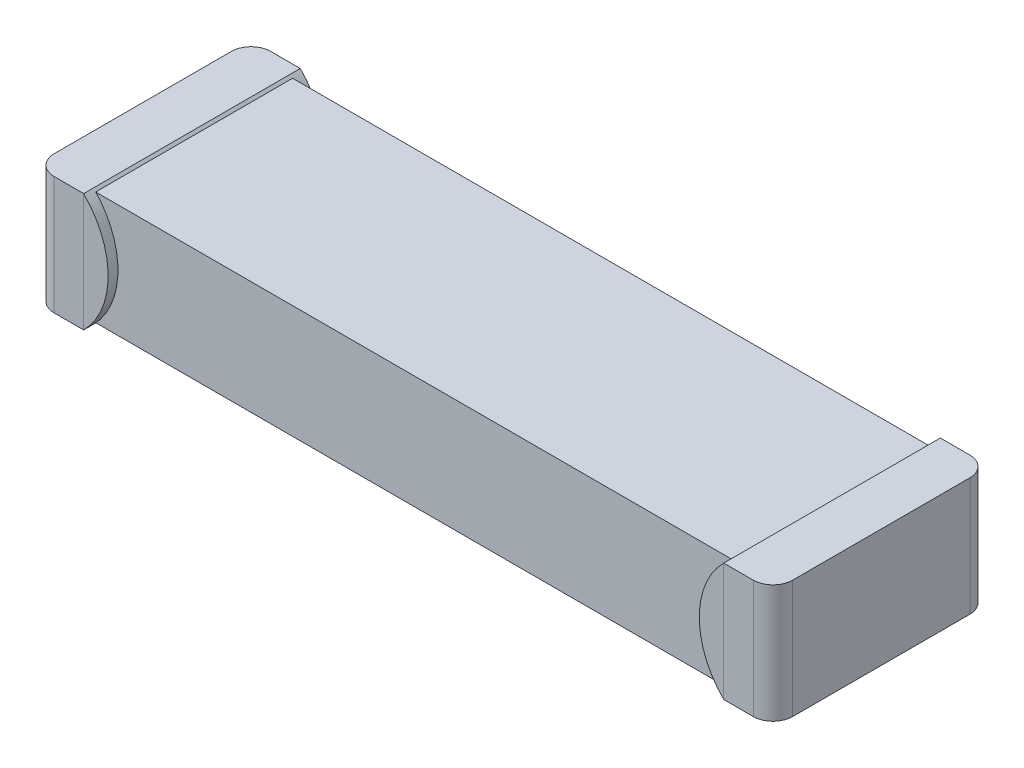
ISO-10303-21;
HEADER;
FILE_DESCRIPTION(('STEP AP214'),'2;1');
FILE_NAME('part.step','',(''),(''),'','','');
FILE_SCHEMA(('AUTOMOTIVE_DESIGN { 1 0 10303 214 1 1 1 1 }'));
ENDSEC;
DATA;
#1=APPLICATION_CONTEXT('core data for automotive mechanical design processes');
#2=APPLICATION_PROTOCOL_DEFINITION('international standard','automotive_design',2000,#1);
#3=PRODUCT_CONTEXT('',#1,'mechanical');
#4=PRODUCT('Part','Part','',(#3));
#5=PRODUCT_RELATED_PRODUCT_CATEGORY('part','',(#4));
#6=PRODUCT_DEFINITION_FORMATION('','',#4);
#7=PRODUCT_DEFINITION_CONTEXT('part definition',#1,'design');
#8=PRODUCT_DEFINITION('design','',#6,#7);
#9=PRODUCT_DEFINITION_SHAPE('','',#8);
#10=(LENGTH_UNIT() NAMED_UNIT(*) SI_UNIT(.MILLI.,.METRE.));
#11=(NAMED_UNIT(*) PLANE_ANGLE_UNIT() SI_UNIT($,.RADIAN.));
#12=(NAMED_UNIT(*) SI_UNIT($,.STERADIAN.) SOLID_ANGLE_UNIT());
#13=UNCERTAINTY_MEASURE_WITH_UNIT(LENGTH_MEASURE(1.E-05),#10,'distance_accuracy_value','');
#14=(GEOMETRIC_REPRESENTATION_CONTEXT(3) GLOBAL_UNCERTAINTY_ASSIGNED_CONTEXT((#13)) GLOBAL_UNIT_ASSIGNED_CONTEXT((#10,
#11,#12)) REPRESENTATION_CONTEXT('',''));
#15=CARTESIAN_POINT('',(0.,0.,0.));
#16=DIRECTION('',(0.,0.,1.));
#17=DIRECTION('',(1.,0.,0.));
#18=AXIS2_PLACEMENT_3D('',#15,#16,#17);
#19=CARTESIAN_POINT('',(-0.100000000000001,0.55,-2.1));
#20=DIRECTION('',(0.,0.,1.));
#21=DIRECTION('',(1.,0.,0.));
#22=AXIS2_PLACEMENT_3D('',#19,#20,#21);
#23=CYLINDRICAL_SURFACE('',#22,0.848528137423857);
#24=CARTESIAN_POINT('',(-0.100000000000001,0.55,0.1));
#25=DIRECTION('',(0.,0.,1.));
#26=DIRECTION('',(-1.,0.,0.));
#27=AXIS2_PLACEMENT_3D('',#24,#25,#26);
#28=CIRCLE('',#27,0.848528137423857);
#29=CARTESIAN_POINT('',(0.5,-0.05,0.1));
#30=VERTEX_POINT('',#29);
#31=CARTESIAN_POINT('',(0.5,1.15,0.1));
#32=VERTEX_POINT('',#31);
#33=EDGE_CURVE('E81',#30,#32,#28,.T.);
#34=ORIENTED_EDGE('',*,*,#33,.F.);
#35=DIRECTION('',(0.,0.,1.));
#36=VECTOR('',#35,1.);
#37=CARTESIAN_POINT('',(0.5,-0.05,-2.1));
#38=LINE('',#37,#36);
#39=CARTESIAN_POINT('',(0.5,-0.05,-2.1));
#40=VERTEX_POINT('',#39);
#41=EDGE_CURVE('E12',#40,#30,#38,.T.);
#42=ORIENTED_EDGE('',*,*,#41,.F.);
#43=CARTESIAN_POINT('',(-0.100000000000001,0.55,-2.1));
#44=DIRECTION('',(0.,0.,1.));
#45=DIRECTION('',(-1.,0.,0.));
#46=AXIS2_PLACEMENT_3D('',#43,#44,#45);
#47=CIRCLE('',#46,0.848528137423857);
#48=CARTESIAN_POINT('',(0.5,1.15,-2.1));
#49=VERTEX_POINT('',#48);
#50=EDGE_CURVE('E85',#40,#49,#47,.T.);
#51=ORIENTED_EDGE('',*,*,#50,.T.);
#52=DIRECTION('',(0.,0.,1.));
#53=VECTOR('',#52,1.);
#54=CARTESIAN_POINT('',(0.5,1.15,-2.1));
#55=LINE('',#54,#53);
#56=EDGE_CURVE('E55',#49,#32,#55,.T.);
#57=ORIENTED_EDGE('',*,*,#56,.T.);
#58=EDGE_LOOP('',(#34,#42,#51,#57));
#59=FACE_BOUND('',#58,.T.);
#60=ADVANCED_FACE('F52',(#59),#23,.T.);
#61=CARTESIAN_POINT('',(0.5,1.15,-2.1));
#62=DIRECTION('',(-1.,0.,0.));
#63=DIRECTION('',(0.,0.,1.));
#64=AXIS2_PLACEMENT_3D('',#61,#62,#63);
#65=PLANE('',#64);
#66=DIRECTION('',(0.,-1.,0.));
#67=VECTOR('',#66,1.);
#68=CARTESIAN_POINT('',(0.5,1.15,0.1));
#69=LINE('',#68,#67);
#70=EDGE_CURVE('E78',#32,#30,#69,.T.);
#71=ORIENTED_EDGE('',*,*,#70,.F.);
#72=ORIENTED_EDGE('',*,*,#56,.F.);
#73=DIRECTION('',(0.,-1.,0.));
#74=VECTOR('',#73,1.);
#75=CARTESIAN_POINT('',(0.5,1.15,-2.1));
#76=LINE('',#75,#74);
#77=EDGE_CURVE('E80',#49,#40,#76,.T.);
#78=ORIENTED_EDGE('',*,*,#77,.T.);
#79=ORIENTED_EDGE('',*,*,#41,.T.);
#80=EDGE_LOOP('',(#71,#72,#78,#79));
#81=FACE_BOUND('',#80,.T.);
#82=ADVANCED_FACE('F76',(#81),#65,.T.);
#83=CARTESIAN_POINT('',(-0.100000000000001,0.55,-2.1));
#84=DIRECTION('',(0.,0.,-1.));
#85=DIRECTION('',(-1.,0.,0.));
#86=AXIS2_PLACEMENT_3D('',#83,#84,#85);
#87=PLANE('',#86);
#88=ORIENTED_EDGE('',*,*,#50,.F.);
#89=ORIENTED_EDGE('',*,*,#77,.F.);
#90=EDGE_LOOP('',(#88,#89));
#91=FACE_BOUND('',#90,.T.);
#92=ADVANCED_FACE('F90',(#91),#87,.T.);
#93=CARTESIAN_POINT('',(-0.100000000000001,0.55,0.1));
#94=DIRECTION('',(0.,0.,-1.));
#95=DIRECTION('',(-1.,0.,0.));
#96=AXIS2_PLACEMENT_3D('',#93,#94,#95);
#97=PLANE('',#96);
#98=ORIENTED_EDGE('',*,*,#33,.T.);
#99=ORIENTED_EDGE('',*,*,#70,.T.);
#100=EDGE_LOOP('',(#98,#99));
#101=FACE_BOUND('',#100,.T.);
#102=ADVANCED_FACE('F84',(#101),#97,.F.);
#103=CLOSED_SHELL('',(#60,#82,#92,#102));
#104=MANIFOLD_SOLID_BREP('B2',#103);
#105=CARTESIAN_POINT('',(7.60007307861119,0.55,-2.1));
#106=DIRECTION('',(0.,0.,1.));
#107=DIRECTION('',(1.,0.,0.));
#108=AXIS2_PLACEMENT_3D('',#105,#106,#107);
#109=CYLINDRICAL_SURFACE('',#108,0.848528137423859);
#110=CARTESIAN_POINT('',(7.60007307861119,0.55,0.1));
#111=DIRECTION('',(0.,0.,1.));
#112=DIRECTION('',(-1.,0.,0.));
#113=AXIS2_PLACEMENT_3D('',#110,#111,#112);
#114=CIRCLE('',#113,0.848528137423859);
#115=CARTESIAN_POINT('',(7.00007307861119,1.15,0.1));
#116=VERTEX_POINT('',#115);
#117=CARTESIAN_POINT('',(7.00007307861119,-0.05,0.1));
#118=VERTEX_POINT('',#117);
#119=EDGE_CURVE('E162',#116,#118,#114,.T.);
#120=ORIENTED_EDGE('',*,*,#119,.F.);
#121=DIRECTION('',(0.,0.,1.));
#122=VECTOR('',#121,1.);
#123=CARTESIAN_POINT('',(7.00007307861119,1.15,-2.1));
#124=LINE('',#123,#122);
#125=CARTESIAN_POINT('',(7.00007307861119,1.15,-2.1));
#126=VERTEX_POINT('',#125);
#127=EDGE_CURVE('E50',#126,#116,#124,.T.);
#128=ORIENTED_EDGE('',*,*,#127,.F.);
#129=CARTESIAN_POINT('',(7.60007307861119,0.55,-2.1));
#130=DIRECTION('',(0.,0.,1.));
#131=DIRECTION('',(-1.,0.,0.));
#132=AXIS2_PLACEMENT_3D('',#129,#130,#131);
#133=CIRCLE('',#132,0.848528137423859);
#134=CARTESIAN_POINT('',(7.00007307861119,-0.05,-2.1));
#135=VERTEX_POINT('',#134);
#136=EDGE_CURVE('E166',#126,#135,#133,.T.);
#137=ORIENTED_EDGE('',*,*,#136,.T.);
#138=DIRECTION('',(0.,0.,1.));
#139=VECTOR('',#138,1.);
#140=CARTESIAN_POINT('',(7.00007307861119,-0.05,-2.1));
#141=LINE('',#140,#139);
#142=EDGE_CURVE('E136',#135,#118,#141,.T.);
#143=ORIENTED_EDGE('',*,*,#142,.T.);
#144=EDGE_LOOP('',(#120,#128,#137,#143));
#145=FACE_BOUND('',#144,.T.);
#146=ADVANCED_FACE('F133',(#145),#109,.T.);
#147=CARTESIAN_POINT('',(7.00007307861119,1.15,-2.1));
#148=DIRECTION('',(1.,0.,0.));
#149=DIRECTION('',(0.,0.,-1.));
#150=AXIS2_PLACEMENT_3D('',#147,#148,#149);
#151=PLANE('',#150);
#152=DIRECTION('',(0.,1.,0.));
#153=VECTOR('',#152,1.);
#154=CARTESIAN_POINT('',(7.00007307861119,1.15,0.1));
#155=LINE('',#154,#153);
#156=EDGE_CURVE('E159',#118,#116,#155,.T.);
#157=ORIENTED_EDGE('',*,*,#156,.F.);
#158=ORIENTED_EDGE('',*,*,#142,.F.);
#159=DIRECTION('',(0.,1.,0.));
#160=VECTOR('',#159,1.);
#161=CARTESIAN_POINT('',(7.00007307861119,1.15,-2.1));
#162=LINE('',#161,#160);
#163=EDGE_CURVE('E161',#135,#126,#162,.T.);
#164=ORIENTED_EDGE('',*,*,#163,.T.);
#165=ORIENTED_EDGE('',*,*,#127,.T.);
#166=EDGE_LOOP('',(#157,#158,#164,#165));
#167=FACE_BOUND('',#166,.T.);
#168=ADVANCED_FACE('F157',(#167),#151,.T.);
#169=CARTESIAN_POINT('',(7.60007307861119,0.55,-2.1));
#170=DIRECTION('',(0.,0.,-1.));
#171=DIRECTION('',(-1.,0.,0.));
#172=AXIS2_PLACEMENT_3D('',#169,#170,#171);
#173=PLANE('',#172);
#174=ORIENTED_EDGE('',*,*,#136,.F.);
#175=ORIENTED_EDGE('',*,*,#163,.F.);
#176=EDGE_LOOP('',(#174,#175));
#177=FACE_BOUND('',#176,.T.);
#178=ADVANCED_FACE('F171',(#177),#173,.T.);
#179=CARTESIAN_POINT('',(7.60007307861119,0.55,0.1));
#180=DIRECTION('',(0.,0.,-1.));
#181=DIRECTION('',(-1.,0.,0.));
#182=AXIS2_PLACEMENT_3D('',#179,#180,#181);
#183=PLANE('',#182);
#184=ORIENTED_EDGE('',*,*,#119,.T.);
#185=ORIENTED_EDGE('',*,*,#156,.T.);
#186=EDGE_LOOP('',(#184,#185));
#187=FACE_BOUND('',#186,.T.);
#188=ADVANCED_FACE('F165',(#187),#183,.F.);
#189=CLOSED_SHELL('',(#146,#168,#178,#188));
#190=MANIFOLD_SOLID_BREP('B6',#189);
#191=CARTESIAN_POINT('',(7.00007307861119,1.15,0.));
#192=DIRECTION('',(1.,0.,0.));
#193=DIRECTION('',(0.,0.,-1.));
#194=AXIS2_PLACEMENT_3D('',#191,#192,#193);
#195=PLANE('',#194);
#196=DIRECTION('',(0.,0.,1.));
#197=VECTOR('',#196,1.);
#198=CARTESIAN_POINT('',(7.00007307861119,-0.05,0.));
#199=LINE('',#198,#197);
#200=CARTESIAN_POINT('',(7.00007307861119,-0.05,-2.1));
#201=VERTEX_POINT('',#200);
#202=CARTESIAN_POINT('',(7.00007307861119,-0.05,0.1));
#203=VERTEX_POINT('',#202);
#204=EDGE_CURVE('E383',#201,#203,#199,.T.);
#205=ORIENTED_EDGE('',*,*,#204,.T.);
#206=DIRECTION('',(0.,-1.,0.));
#207=VECTOR('',#206,1.);
#208=CARTESIAN_POINT('',(7.00007307861119,1.15,0.1));
#209=LINE('',#208,#207);
#210=CARTESIAN_POINT('',(7.00007307861119,1.15,0.1));
#211=VERTEX_POINT('',#210);
#212=EDGE_CURVE('E377',#211,#203,#209,.T.);
#213=ORIENTED_EDGE('',*,*,#212,.F.);
#214=DIRECTION('',(0.,0.,1.));
#215=VECTOR('',#214,1.);
#216=CARTESIAN_POINT('',(7.00007307861119,1.15,0.));
#217=LINE('',#216,#215);
#218=CARTESIAN_POINT('',(7.00007307861119,1.15,-2.1));
#219=VERTEX_POINT('',#218);
#220=EDGE_CURVE('E373',#219,#211,#217,.T.);
#221=ORIENTED_EDGE('',*,*,#220,.F.);
#222=DIRECTION('',(0.,-1.,0.));
#223=VECTOR('',#222,1.);
#224=CARTESIAN_POINT('',(7.00007307861119,1.15,-2.1));
#225=LINE('',#224,#223);
#226=EDGE_CURVE('E388',#219,#201,#225,.T.);
#227=ORIENTED_EDGE('',*,*,#226,.T.);
#228=EDGE_LOOP('',(#205,#213,#221,#227));
#229=FACE_BOUND('',#228,.T.);
#230=DIRECTION('',(0.,1.,0.));
#231=VECTOR('',#230,1.);
#232=CARTESIAN_POINT('',(7.00007307861119,1.125,-2.));
#233=LINE('',#232,#231);
#234=CARTESIAN_POINT('',(7.00007307861119,-0.025,-2.));
#235=VERTEX_POINT('',#234);
#236=CARTESIAN_POINT('',(7.00007307861119,1.125,-2.));
#237=VERTEX_POINT('',#236);
#238=EDGE_CURVE('E390',#235,#237,#233,.T.);
#239=ORIENTED_EDGE('',*,*,#238,.T.);
#240=DIRECTION('',(0.,0.,1.));
#241=VECTOR('',#240,1.);
#242=CARTESIAN_POINT('',(7.00007307861119,1.125,0.));
#243=LINE('',#242,#241);
#244=CARTESIAN_POINT('',(7.00007307861119,1.125,0.));
#245=VERTEX_POINT('',#244);
#246=EDGE_CURVE('E395',#237,#245,#243,.T.);
#247=ORIENTED_EDGE('',*,*,#246,.T.);
#248=DIRECTION('',(0.,-1.,0.));
#249=VECTOR('',#248,1.);
#250=CARTESIAN_POINT('',(7.00007307861119,1.125,0.));
#251=LINE('',#250,#249);
#252=CARTESIAN_POINT('',(7.00007307861118,-0.025,0.));
#253=VERTEX_POINT('',#252);
#254=EDGE_CURVE('E392',#245,#253,#251,.T.);
#255=ORIENTED_EDGE('',*,*,#254,.T.);
#256=DIRECTION('',(0.,0.,1.));
#257=VECTOR('',#256,1.);
#258=CARTESIAN_POINT('',(7.00007307861119,-0.025,0.));
#259=LINE('',#258,#257);
#260=EDGE_CURVE('E405',#235,#253,#259,.T.);
#261=ORIENTED_EDGE('',*,*,#260,.F.);
#262=EDGE_LOOP('',(#239,#247,#255,#261));
#263=FACE_BOUND('',#262,.T.);
#264=ADVANCED_FACE('F205',(#229,#263),#195,.F.);
#265=CARTESIAN_POINT('',(7.50007307861119,1.15,0.));
#266=DIRECTION('',(1.,0.,0.));
#267=DIRECTION('',(0.,0.,-1.));
#268=AXIS2_PLACEMENT_3D('',#265,#266,#267);
#269=PLANE('',#268);
#270=DIRECTION('',(0.,0.,1.));
#271=VECTOR('',#270,1.);
#272=CARTESIAN_POINT('',(7.50007307861119,-0.05,0.));
#273=LINE('',#272,#271);
#274=CARTESIAN_POINT('',(7.50007307861119,-0.05,-1.9));
#275=VERTEX_POINT('',#274);
#276=CARTESIAN_POINT('',(7.50007307861119,-0.05,-0.1));
#277=VERTEX_POINT('',#276);
#278=EDGE_CURVE('E366',#275,#277,#273,.T.);
#279=ORIENTED_EDGE('',*,*,#278,.F.);
#280=DIRECTION('',(0.,-1.,0.));
#281=VECTOR('',#280,1.);
#282=CARTESIAN_POINT('',(7.50007307861119,1.15,-1.9));
#283=LINE('',#282,#281);
#284=CARTESIAN_POINT('',(7.50007307861119,1.15,-1.9));
#285=VERTEX_POINT('',#284);
#286=EDGE_CURVE('E441',#275,#285,#283,.F.);
#287=ORIENTED_EDGE('',*,*,#286,.T.);
#288=DIRECTION('',(0.,0.,1.));
#289=VECTOR('',#288,1.);
#290=CARTESIAN_POINT('',(7.50007307861119,1.15,0.));
#291=LINE('',#290,#289);
#292=CARTESIAN_POINT('',(7.50007307861119,1.15,-0.1));
#293=VERTEX_POINT('',#292);
#294=EDGE_CURVE('E367',#285,#293,#291,.T.);
#295=ORIENTED_EDGE('',*,*,#294,.T.);
#296=DIRECTION('',(0.,-1.,0.));
#297=VECTOR('',#296,1.);
#298=CARTESIAN_POINT('',(7.50007307861119,-0.0499999999999999,-0.1));
#299=LINE('',#298,#297);
#300=EDGE_CURVE('E438',#293,#277,#299,.T.);
#301=ORIENTED_EDGE('',*,*,#300,.T.);
#302=EDGE_LOOP('',(#279,#287,#295,#301));
#303=FACE_BOUND('',#302,.T.);
#304=ADVANCED_FACE('F459',(#303),#269,.T.);
#305=CARTESIAN_POINT('',(0.,1.15,-2.1));
#306=DIRECTION('',(0.,0.,-1.));
#307=DIRECTION('',(-1.,0.,0.));
#308=AXIS2_PLACEMENT_3D('',#305,#306,#307);
#309=PLANE('',#308);
#310=DIRECTION('',(1.,0.,0.));
#311=VECTOR('',#310,1.);
#312=CARTESIAN_POINT('',(0.,1.15,-2.1));
#313=LINE('',#312,#311);
#314=CARTESIAN_POINT('',(7.30007307861119,1.15,-2.1));
#315=VERTEX_POINT('',#314);
#316=EDGE_CURVE('E369',#219,#315,#313,.T.);
#317=ORIENTED_EDGE('',*,*,#316,.T.);
#318=DIRECTION('',(0.,-1.,0.));
#319=VECTOR('',#318,1.);
#320=CARTESIAN_POINT('',(7.30007307861119,1.15,-2.1));
#321=LINE('',#320,#319);
#322=CARTESIAN_POINT('',(7.30007307861119,-0.05,-2.1));
#323=VERTEX_POINT('',#322);
#324=EDGE_CURVE('E431',#315,#323,#321,.T.);
#325=ORIENTED_EDGE('',*,*,#324,.T.);
#326=DIRECTION('',(1.,0.,0.));
#327=VECTOR('',#326,1.);
#328=CARTESIAN_POINT('',(0.,-0.05,-2.1));
#329=LINE('',#328,#327);
#330=EDGE_CURVE('E380',#201,#323,#329,.T.);
#331=ORIENTED_EDGE('',*,*,#330,.F.);
#332=ORIENTED_EDGE('',*,*,#226,.F.);
#333=EDGE_LOOP('',(#317,#325,#331,#332));
#334=FACE_BOUND('',#333,.T.);
#335=ADVANCED_FACE('F450',(#334),#309,.T.);
#336=CARTESIAN_POINT('',(0.,1.15,0.1));
#337=DIRECTION('',(0.,0.,-1.));
#338=DIRECTION('',(-1.,0.,0.));
#339=AXIS2_PLACEMENT_3D('',#336,#337,#338);
#340=PLANE('',#339);
#341=DIRECTION('',(1.,0.,0.));
#342=VECTOR('',#341,1.);
#343=CARTESIAN_POINT('',(0.,-0.05,0.1));
#344=LINE('',#343,#342);
#345=CARTESIAN_POINT('',(7.30007307861119,-0.05,0.1));
#346=VERTEX_POINT('',#345);
#347=EDGE_CURVE('E370',#203,#346,#344,.T.);
#348=ORIENTED_EDGE('',*,*,#347,.T.);
#349=DIRECTION('',(0.,-1.,0.));
#350=VECTOR('',#349,1.);
#351=CARTESIAN_POINT('',(7.30007307861119,1.15,0.1));
#352=LINE('',#351,#350);
#353=CARTESIAN_POINT('',(7.30007307861119,1.15,0.1));
#354=VERTEX_POINT('',#353);
#355=EDGE_CURVE('E131',#346,#354,#352,.F.);
#356=ORIENTED_EDGE('',*,*,#355,.T.);
#357=DIRECTION('',(1.,0.,0.));
#358=VECTOR('',#357,1.);
#359=CARTESIAN_POINT('',(0.,1.15,0.1));
#360=LINE('',#359,#358);
#361=EDGE_CURVE('E375',#211,#354,#360,.T.);
#362=ORIENTED_EDGE('',*,*,#361,.F.);
#363=ORIENTED_EDGE('',*,*,#212,.T.);
#364=EDGE_LOOP('',(#348,#356,#362,#363));
#365=FACE_BOUND('',#364,.T.);
#366=ADVANCED_FACE('F463',(#365),#340,.F.);
#367=CARTESIAN_POINT('',(0.,1.15,0.));
#368=DIRECTION('',(0.,1.,0.));
#369=DIRECTION('',(0.,0.,1.));
#370=AXIS2_PLACEMENT_3D('',#367,#368,#369);
#371=PLANE('',#370);
#372=ORIENTED_EDGE('',*,*,#294,.F.);
#373=CARTESIAN_POINT('',(7.30007307861119,1.15,-1.9));
#374=DIRECTION('',(0.,1.,0.));
#375=DIRECTION('',(0.,0.,1.));
#376=AXIS2_PLACEMENT_3D('',#373,#374,#375);
#377=CIRCLE('',#376,0.2);
#378=EDGE_CURVE('E213',#285,#315,#377,.T.);
#379=ORIENTED_EDGE('',*,*,#378,.T.);
#380=ORIENTED_EDGE('',*,*,#316,.F.);
#381=ORIENTED_EDGE('',*,*,#220,.T.);
#382=ORIENTED_EDGE('',*,*,#361,.T.);
#383=CARTESIAN_POINT('',(7.30007307861119,1.15,-0.1));
#384=DIRECTION('',(0.,1.,0.));
#385=DIRECTION('',(0.,0.,1.));
#386=AXIS2_PLACEMENT_3D('',#383,#384,#385);
#387=CIRCLE('',#386,0.2);
#388=EDGE_CURVE('E225',#354,#293,#387,.T.);
#389=ORIENTED_EDGE('',*,*,#388,.T.);
#390=EDGE_LOOP('',(#372,#379,#380,#381,#382,#389));
#391=FACE_BOUND('',#390,.T.);
#392=ADVANCED_FACE('F445',(#391),#371,.T.);
#393=CARTESIAN_POINT('',(0.,-0.05,0.));
#394=DIRECTION('',(0.,1.,0.));
#395=DIRECTION('',(0.,0.,1.));
#396=AXIS2_PLACEMENT_3D('',#393,#394,#395);
#397=PLANE('',#396);
#398=ORIENTED_EDGE('',*,*,#330,.T.);
#399=CARTESIAN_POINT('',(7.30007307861119,-0.0499999999999999,-1.9));
#400=DIRECTION('',(0.,1.,0.));
#401=DIRECTION('',(0.,0.,1.));
#402=AXIS2_PLACEMENT_3D('',#399,#400,#401);
#403=CIRCLE('',#402,0.2);
#404=EDGE_CURVE('E436',#323,#275,#403,.F.);
#405=ORIENTED_EDGE('',*,*,#404,.T.);
#406=ORIENTED_EDGE('',*,*,#278,.T.);
#407=CARTESIAN_POINT('',(7.30007307861119,-0.0499999999999999,-0.1));
#408=DIRECTION('',(0.,1.,0.));
#409=DIRECTION('',(0.,0.,1.));
#410=AXIS2_PLACEMENT_3D('',#407,#408,#409);
#411=CIRCLE('',#410,0.2);
#412=EDGE_CURVE('E434',#277,#346,#411,.F.);
#413=ORIENTED_EDGE('',*,*,#412,.T.);
#414=ORIENTED_EDGE('',*,*,#347,.F.);
#415=ORIENTED_EDGE('',*,*,#204,.F.);
#416=EDGE_LOOP('',(#398,#405,#406,#413,#414,#415));
#417=FACE_BOUND('',#416,.T.);
#418=ADVANCED_FACE('F456',(#417),#397,.F.);
#419=CARTESIAN_POINT('',(0.,1.125,0.));
#420=DIRECTION('',(0.,0.,-1.));
#421=DIRECTION('',(-1.,0.,0.));
#422=AXIS2_PLACEMENT_3D('',#419,#420,#421);
#423=PLANE('',#422);
#424=DIRECTION('',(1.,0.,0.));
#425=VECTOR('',#424,1.);
#426=CARTESIAN_POINT('',(0.,1.125,0.));
#427=LINE('',#426,#425);
#428=CARTESIAN_POINT('',(0.5,1.125,0.));
#429=VERTEX_POINT('',#428);
#430=EDGE_CURVE('E399',#429,#245,#427,.T.);
#431=ORIENTED_EDGE('',*,*,#430,.F.);
#432=DIRECTION('',(0.,-1.,0.));
#433=VECTOR('',#432,1.);
#434=CARTESIAN_POINT('',(0.5,1.125,0.));
#435=LINE('',#434,#433);
#436=CARTESIAN_POINT('',(0.5,-0.025,0.));
#437=VERTEX_POINT('',#436);
#438=EDGE_CURVE('E361',#429,#437,#435,.T.);
#439=ORIENTED_EDGE('',*,*,#438,.T.);
#440=DIRECTION('',(1.,0.,0.));
#441=VECTOR('',#440,1.);
#442=CARTESIAN_POINT('',(0.,-0.025,0.));
#443=LINE('',#442,#441);
#444=EDGE_CURVE('E398',#437,#253,#443,.T.);
#445=ORIENTED_EDGE('',*,*,#444,.T.);
#446=ORIENTED_EDGE('',*,*,#254,.F.);
#447=EDGE_LOOP('',(#431,#439,#445,#446));
#448=FACE_BOUND('',#447,.T.);
#449=ADVANCED_FACE('F483',(#448),#423,.F.);
#450=CARTESIAN_POINT('',(0.,1.125,-2.));
#451=DIRECTION('',(0.,0.,1.));
#452=DIRECTION('',(1.,0.,0.));
#453=AXIS2_PLACEMENT_3D('',#450,#451,#452);
#454=PLANE('',#453);
#455=DIRECTION('',(-1.,0.,0.));
#456=VECTOR('',#455,1.);
#457=CARTESIAN_POINT('',(0.,-0.025,-2.));
#458=LINE('',#457,#456);
#459=CARTESIAN_POINT('',(0.5,-0.025,-2.));
#460=VERTEX_POINT('',#459);
#461=EDGE_CURVE('E402',#235,#460,#458,.T.);
#462=ORIENTED_EDGE('',*,*,#461,.T.);
#463=DIRECTION('',(0.,1.,0.));
#464=VECTOR('',#463,1.);
#465=CARTESIAN_POINT('',(0.5,1.125,-2.));
#466=LINE('',#465,#464);
#467=CARTESIAN_POINT('',(0.5,1.125,-2.));
#468=VERTEX_POINT('',#467);
#469=EDGE_CURVE('E348',#460,#468,#466,.T.);
#470=ORIENTED_EDGE('',*,*,#469,.T.);
#471=DIRECTION('',(-1.,0.,0.));
#472=VECTOR('',#471,1.);
#473=CARTESIAN_POINT('',(0.,1.125,-2.));
#474=LINE('',#473,#472);
#475=EDGE_CURVE('E401',#237,#468,#474,.T.);
#476=ORIENTED_EDGE('',*,*,#475,.F.);
#477=ORIENTED_EDGE('',*,*,#238,.F.);
#478=EDGE_LOOP('',(#462,#470,#476,#477));
#479=FACE_BOUND('',#478,.T.);
#480=ADVANCED_FACE('F479',(#479),#454,.F.);
#481=CARTESIAN_POINT('',(0.,1.125,0.));
#482=DIRECTION('',(0.,-1.,0.));
#483=DIRECTION('',(0.,0.,-1.));
#484=AXIS2_PLACEMENT_3D('',#481,#482,#483);
#485=PLANE('',#484);
#486=ORIENTED_EDGE('',*,*,#475,.T.);
#487=DIRECTION('',(0.,0.,1.));
#488=VECTOR('',#487,1.);
#489=CARTESIAN_POINT('',(0.5,1.125,0.));
#490=LINE('',#489,#488);
#491=EDGE_CURVE('E364',#468,#429,#490,.T.);
#492=ORIENTED_EDGE('',*,*,#491,.T.);
#493=ORIENTED_EDGE('',*,*,#430,.T.);
#494=ORIENTED_EDGE('',*,*,#246,.F.);
#495=EDGE_LOOP('',(#486,#492,#493,#494));
#496=FACE_BOUND('',#495,.T.);
#497=ADVANCED_FACE('F476',(#496),#485,.F.);
#498=CARTESIAN_POINT('',(0.,-0.025,0.));
#499=DIRECTION('',(0.,-1.,0.));
#500=DIRECTION('',(0.,0.,-1.));
#501=AXIS2_PLACEMENT_3D('',#498,#499,#500);
#502=PLANE('',#501);
#503=DIRECTION('',(0.,0.,1.));
#504=VECTOR('',#503,1.);
#505=CARTESIAN_POINT('',(0.5,-0.025,0.));
#506=LINE('',#505,#504);
#507=EDGE_CURVE('E412',#460,#437,#506,.T.);
#508=ORIENTED_EDGE('',*,*,#507,.F.);
#509=ORIENTED_EDGE('',*,*,#461,.F.);
#510=ORIENTED_EDGE('',*,*,#260,.T.);
#511=ORIENTED_EDGE('',*,*,#444,.F.);
#512=EDGE_LOOP('',(#508,#509,#510,#511));
#513=FACE_BOUND('',#512,.T.);
#514=ADVANCED_FACE('F485',(#513),#502,.T.);
#515=CARTESIAN_POINT('',(0.5,1.15,-2.1));
#516=DIRECTION('',(1.,0.,0.));
#517=DIRECTION('',(0.,0.,-1.));
#518=AXIS2_PLACEMENT_3D('',#515,#516,#517);
#519=PLANE('',#518);
#520=DIRECTION('',(0.,0.,1.));
#521=VECTOR('',#520,1.);
#522=CARTESIAN_POINT('',(0.5,-0.05,-2.1));
#523=LINE('',#522,#521);
#524=CARTESIAN_POINT('',(0.5,-0.05,-2.1));
#525=VERTEX_POINT('',#524);
#526=CARTESIAN_POINT('',(0.5,-0.05,0.1));
#527=VERTEX_POINT('',#526);
#528=EDGE_CURVE('E330',#525,#527,#523,.T.);
#529=ORIENTED_EDGE('',*,*,#528,.F.);
#530=DIRECTION('',(0.,-1.,0.));
#531=VECTOR('',#530,1.);
#532=CARTESIAN_POINT('',(0.5,1.15,-2.1));
#533=LINE('',#532,#531);
#534=CARTESIAN_POINT('',(0.5,1.15,-2.1));
#535=VERTEX_POINT('',#534);
#536=EDGE_CURVE('E340',#535,#525,#533,.T.);
#537=ORIENTED_EDGE('',*,*,#536,.F.);
#538=DIRECTION('',(0.,0.,1.));
#539=VECTOR('',#538,1.);
#540=CARTESIAN_POINT('',(0.5,1.15,-2.1));
#541=LINE('',#540,#539);
#542=CARTESIAN_POINT('',(0.5,1.15,0.1));
#543=VERTEX_POINT('',#542);
#544=EDGE_CURVE('E339',#535,#543,#541,.T.);
#545=ORIENTED_EDGE('',*,*,#544,.T.);
#546=DIRECTION('',(0.,-1.,0.));
#547=VECTOR('',#546,1.);
#548=CARTESIAN_POINT('',(0.5,1.15,0.1));
#549=LINE('',#548,#547);
#550=EDGE_CURVE('E324',#543,#527,#549,.T.);
#551=ORIENTED_EDGE('',*,*,#550,.T.);
#552=EDGE_LOOP('',(#529,#537,#545,#551));
#553=FACE_BOUND('',#552,.T.);
#554=ORIENTED_EDGE('',*,*,#491,.F.);
#555=ORIENTED_EDGE('',*,*,#469,.F.);
#556=ORIENTED_EDGE('',*,*,#507,.T.);
#557=ORIENTED_EDGE('',*,*,#438,.F.);
#558=EDGE_LOOP('',(#554,#555,#556,#557));
#559=FACE_BOUND('',#558,.T.);
#560=ADVANCED_FACE('F335',(#553,#559),#519,.T.);
#561=CARTESIAN_POINT('',(0.,1.15,-2.1));
#562=DIRECTION('',(0.,0.,-1.));
#563=DIRECTION('',(-1.,0.,0.));
#564=AXIS2_PLACEMENT_3D('',#561,#562,#563);
#565=PLANE('',#564);
#566=DIRECTION('',(1.,0.,0.));
#567=VECTOR('',#566,1.);
#568=CARTESIAN_POINT('',(0.,-0.05,-2.1));
#569=LINE('',#568,#567);
#570=CARTESIAN_POINT('',(0.2,-0.05,-2.1));
#571=VERTEX_POINT('',#570);
#572=EDGE_CURVE('E345',#571,#525,#569,.T.);
#573=ORIENTED_EDGE('',*,*,#572,.F.);
#574=DIRECTION('',(0.,-1.,0.));
#575=VECTOR('',#574,1.);
#576=CARTESIAN_POINT('',(0.2,1.15,-2.1));
#577=LINE('',#576,#575);
#578=CARTESIAN_POINT('',(0.2,1.15,-2.1));
#579=VERTEX_POINT('',#578);
#580=EDGE_CURVE('E424',#571,#579,#577,.F.);
#581=ORIENTED_EDGE('',*,*,#580,.T.);
#582=DIRECTION('',(1.,0.,0.));
#583=VECTOR('',#582,1.);
#584=CARTESIAN_POINT('',(0.,1.15,-2.1));
#585=LINE('',#584,#583);
#586=EDGE_CURVE('E358',#579,#535,#585,.T.);
#587=ORIENTED_EDGE('',*,*,#586,.T.);
#588=ORIENTED_EDGE('',*,*,#536,.T.);
#589=EDGE_LOOP('',(#573,#581,#587,#588));
#590=FACE_BOUND('',#589,.T.);
#591=ADVANCED_FACE('F492',(#590),#565,.T.);
#592=CARTESIAN_POINT('',(0.,1.15,0.1));
#593=DIRECTION('',(0.,0.,-1.));
#594=DIRECTION('',(-1.,0.,0.));
#595=AXIS2_PLACEMENT_3D('',#592,#593,#594);
#596=PLANE('',#595);
#597=DIRECTION('',(1.,0.,0.));
#598=VECTOR('',#597,1.);
#599=CARTESIAN_POINT('',(0.,1.15,0.1));
#600=LINE('',#599,#598);
#601=CARTESIAN_POINT('',(0.2,1.15,0.1));
#602=VERTEX_POINT('',#601);
#603=EDGE_CURVE('E355',#602,#543,#600,.T.);
#604=ORIENTED_EDGE('',*,*,#603,.F.);
#605=DIRECTION('',(0.,-1.,0.));
#606=VECTOR('',#605,1.);
#607=CARTESIAN_POINT('',(0.2,1.15,0.1));
#608=LINE('',#607,#606);
#609=CARTESIAN_POINT('',(0.2,-0.05,0.1));
#610=VERTEX_POINT('',#609);
#611=EDGE_CURVE('E327',#602,#610,#608,.T.);
#612=ORIENTED_EDGE('',*,*,#611,.T.);
#613=DIRECTION('',(1.,0.,0.));
#614=VECTOR('',#613,1.);
#615=CARTESIAN_POINT('',(0.,-0.05,0.1));
#616=LINE('',#615,#614);
#617=EDGE_CURVE('E320',#610,#527,#616,.T.);
#618=ORIENTED_EDGE('',*,*,#617,.T.);
#619=ORIENTED_EDGE('',*,*,#550,.F.);
#620=EDGE_LOOP('',(#604,#612,#618,#619));
#621=FACE_BOUND('',#620,.T.);
#622=ADVANCED_FACE('F323',(#621),#596,.F.);
#623=CARTESIAN_POINT('',(0.,1.15,0.));
#624=DIRECTION('',(0.,-1.,0.));
#625=DIRECTION('',(0.,0.,-1.));
#626=AXIS2_PLACEMENT_3D('',#623,#624,#625);
#627=PLANE('',#626);
#628=ORIENTED_EDGE('',*,*,#586,.F.);
#629=CARTESIAN_POINT('',(0.2,1.15,-1.9));
#630=DIRECTION('',(0.,-1.,0.));
#631=DIRECTION('',(0.,0.,-1.));
#632=AXIS2_PLACEMENT_3D('',#629,#630,#631);
#633=CIRCLE('',#632,0.2);
#634=CARTESIAN_POINT('',(0.,1.15,-1.9));
#635=VERTEX_POINT('',#634);
#636=EDGE_CURVE('E428',#579,#635,#633,.F.);
#637=ORIENTED_EDGE('',*,*,#636,.T.);
#638=DIRECTION('',(0.,0.,1.));
#639=VECTOR('',#638,1.);
#640=CARTESIAN_POINT('',(0.,1.15,-2.1));
#641=LINE('',#640,#639);
#642=CARTESIAN_POINT('',(0.,1.15,-0.0999999999999998));
#643=VERTEX_POINT('',#642);
#644=EDGE_CURVE('E352',#635,#643,#641,.T.);
#645=ORIENTED_EDGE('',*,*,#644,.T.);
#646=CARTESIAN_POINT('',(0.2,1.15,-0.1));
#647=DIRECTION('',(0.,-1.,0.));
#648=DIRECTION('',(0.,0.,-1.));
#649=AXIS2_PLACEMENT_3D('',#646,#647,#648);
#650=CIRCLE('',#649,0.2);
#651=EDGE_CURVE('E426',#643,#602,#650,.F.);
#652=ORIENTED_EDGE('',*,*,#651,.T.);
#653=ORIENTED_EDGE('',*,*,#603,.T.);
#654=ORIENTED_EDGE('',*,*,#544,.F.);
#655=EDGE_LOOP('',(#628,#637,#645,#652,#653,#654));
#656=FACE_BOUND('',#655,.T.);
#657=ADVANCED_FACE('F550',(#656),#627,.F.);
#658=CARTESIAN_POINT('',(0.,-0.05,0.));
#659=DIRECTION('',(0.,-1.,0.));
#660=DIRECTION('',(0.,0.,-1.));
#661=AXIS2_PLACEMENT_3D('',#658,#659,#660);
#662=PLANE('',#661);
#663=DIRECTION('',(0.,0.,1.));
#664=VECTOR('',#663,1.);
#665=CARTESIAN_POINT('',(0.,-0.05,-2.1));
#666=LINE('',#665,#664);
#667=CARTESIAN_POINT('',(0.,-0.05,-1.9));
#668=VERTEX_POINT('',#667);
#669=CARTESIAN_POINT('',(0.,-0.05,-0.0999999999999998));
#670=VERTEX_POINT('',#669);
#671=EDGE_CURVE('E331',#668,#670,#666,.T.);
#672=ORIENTED_EDGE('',*,*,#671,.F.);
#673=CARTESIAN_POINT('',(0.2,-0.0499999999999999,-1.9));
#674=DIRECTION('',(0.,-1.,0.));
#675=DIRECTION('',(0.,0.,-1.));
#676=AXIS2_PLACEMENT_3D('',#673,#674,#675);
#677=CIRCLE('',#676,0.2);
#678=EDGE_CURVE('E422',#668,#571,#677,.T.);
#679=ORIENTED_EDGE('',*,*,#678,.T.);
#680=ORIENTED_EDGE('',*,*,#572,.T.);
#681=ORIENTED_EDGE('',*,*,#528,.T.);
#682=ORIENTED_EDGE('',*,*,#617,.F.);
#683=CARTESIAN_POINT('',(0.2,-0.0499999999999999,-0.1));
#684=DIRECTION('',(0.,-1.,0.));
#685=DIRECTION('',(0.,0.,-1.));
#686=AXIS2_PLACEMENT_3D('',#683,#684,#685);
#687=CIRCLE('',#686,0.2);
#688=EDGE_CURVE('E420',#610,#670,#687,.T.);
#689=ORIENTED_EDGE('',*,*,#688,.T.);
#690=EDGE_LOOP('',(#672,#679,#680,#681,#682,#689));
#691=FACE_BOUND('',#690,.T.);
#692=ADVANCED_FACE('F343',(#691),#662,.T.);
#693=CARTESIAN_POINT('',(0.,1.125,0.));
#694=DIRECTION('',(1.,0.,0.));
#695=DIRECTION('',(0.,0.,-1.));
#696=AXIS2_PLACEMENT_3D('',#693,#694,#695);
#697=PLANE('',#696);
#698=ORIENTED_EDGE('',*,*,#644,.F.);
#699=DIRECTION('',(0.,-1.,0.));
#700=VECTOR('',#699,1.);
#701=CARTESIAN_POINT('',(0.,-0.0499999999999999,-1.9));
#702=LINE('',#701,#700);
#703=EDGE_CURVE('E417',#635,#668,#702,.T.);
#704=ORIENTED_EDGE('',*,*,#703,.T.);
#705=ORIENTED_EDGE('',*,*,#671,.T.);
#706=DIRECTION('',(0.,-1.,0.));
#707=VECTOR('',#706,1.);
#708=CARTESIAN_POINT('',(0.,1.125,-0.1));
#709=LINE('',#708,#707);
#710=EDGE_CURVE('E415',#670,#643,#709,.F.);
#711=ORIENTED_EDGE('',*,*,#710,.T.);
#712=EDGE_LOOP('',(#698,#704,#705,#711));
#713=FACE_BOUND('',#712,.T.);
#714=ADVANCED_FACE('F501',(#713),#697,.F.);
#715=CARTESIAN_POINT('',(0.2,1.125,-1.9));
#716=DIRECTION('',(0.,1.,0.));
#717=DIRECTION('',(0.,0.,1.));
#718=AXIS2_PLACEMENT_3D('',#715,#716,#717);
#719=CYLINDRICAL_SURFACE('',#718,0.2);
#720=ORIENTED_EDGE('',*,*,#636,.F.);
#721=ORIENTED_EDGE('',*,*,#580,.F.);
#722=ORIENTED_EDGE('',*,*,#678,.F.);
#723=ORIENTED_EDGE('',*,*,#703,.F.);
#724=EDGE_LOOP('',(#720,#721,#722,#723));
#725=FACE_BOUND('',#724,.T.);
#726=ADVANCED_FACE('F504',(#725),#719,.T.);
#727=CARTESIAN_POINT('',(0.2,1.15,-0.1));
#728=DIRECTION('',(0.,-1.,0.));
#729=DIRECTION('',(0.,0.,-1.));
#730=AXIS2_PLACEMENT_3D('',#727,#728,#729);
#731=CYLINDRICAL_SURFACE('',#730,0.2);
#732=ORIENTED_EDGE('',*,*,#651,.F.);
#733=ORIENTED_EDGE('',*,*,#710,.F.);
#734=ORIENTED_EDGE('',*,*,#688,.F.);
#735=ORIENTED_EDGE('',*,*,#611,.F.);
#736=EDGE_LOOP('',(#732,#733,#734,#735));
#737=FACE_BOUND('',#736,.T.);
#738=ADVANCED_FACE('F508',(#737),#731,.T.);
#739=CARTESIAN_POINT('',(7.30007307861119,1.15,-1.9));
#740=DIRECTION('',(0.,-1.,0.));
#741=DIRECTION('',(0.,0.,-1.));
#742=AXIS2_PLACEMENT_3D('',#739,#740,#741);
#743=CYLINDRICAL_SURFACE('',#742,0.2);
#744=ORIENTED_EDGE('',*,*,#378,.F.);
#745=ORIENTED_EDGE('',*,*,#286,.F.);
#746=ORIENTED_EDGE('',*,*,#404,.F.);
#747=ORIENTED_EDGE('',*,*,#324,.F.);
#748=EDGE_LOOP('',(#744,#745,#746,#747));
#749=FACE_BOUND('',#748,.T.);
#750=ADVANCED_FACE('F453',(#749),#743,.T.);
#751=CARTESIAN_POINT('',(7.30007307861119,1.15,-0.1));
#752=DIRECTION('',(0.,1.,0.));
#753=DIRECTION('',(0.,0.,1.));
#754=AXIS2_PLACEMENT_3D('',#751,#752,#753);
#755=CYLINDRICAL_SURFACE('',#754,0.2);
#756=ORIENTED_EDGE('',*,*,#388,.F.);
#757=ORIENTED_EDGE('',*,*,#355,.F.);
#758=ORIENTED_EDGE('',*,*,#412,.F.);
#759=ORIENTED_EDGE('',*,*,#300,.F.);
#760=EDGE_LOOP('',(#756,#757,#758,#759));
#761=FACE_BOUND('',#760,.T.);
#762=ADVANCED_FACE('F207',(#761),#755,.T.);
#763=CLOSED_SHELL('',(#264,#304,#335,#366,#392,#418,#449,#480,#497,#514,#560,#591,#622,#657,
#692,#714,#726,#738,#750,#762));
#764=MANIFOLD_SOLID_BREP('B44',#763);
#765=ADVANCED_BREP_SHAPE_REPRESENTATION('',(#18,#104,#190,#764),#14);
#766=SHAPE_DEFINITION_REPRESENTATION(#9,#765);
ENDSEC;
END-ISO-10303-21;
